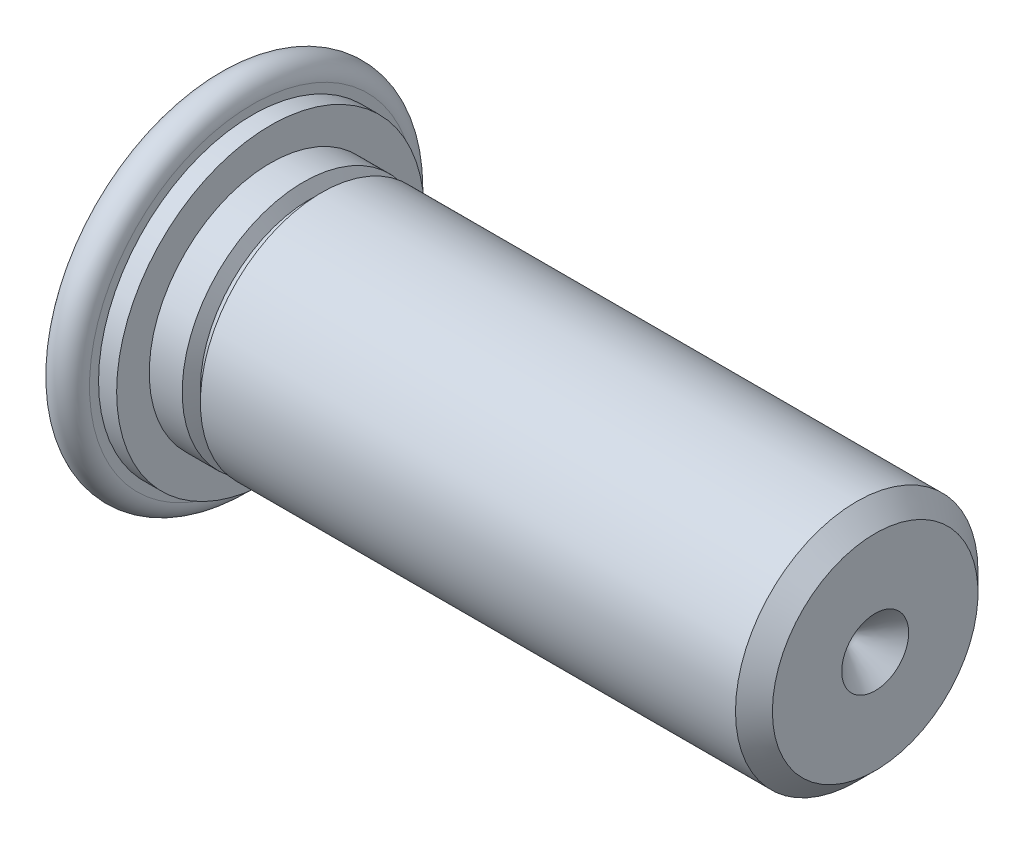
ISO-10303-21;
HEADER;
FILE_DESCRIPTION(('STEP AP214'),'2;1');
FILE_NAME('part.step','',(''),(''),'','','');
FILE_SCHEMA(('AUTOMOTIVE_DESIGN { 1 0 10303 214 1 1 1 1 }'));
ENDSEC;
DATA;
#1=APPLICATION_CONTEXT('core data for automotive mechanical design processes');
#2=APPLICATION_PROTOCOL_DEFINITION('international standard','automotive_design',2000,#1);
#3=PRODUCT_CONTEXT('',#1,'mechanical');
#4=PRODUCT('Part','Part','',(#3));
#5=PRODUCT_RELATED_PRODUCT_CATEGORY('part','',(#4));
#6=PRODUCT_DEFINITION_FORMATION('','',#4);
#7=PRODUCT_DEFINITION_CONTEXT('part definition',#1,'design');
#8=PRODUCT_DEFINITION('design','',#6,#7);
#9=PRODUCT_DEFINITION_SHAPE('','',#8);
#10=(LENGTH_UNIT() NAMED_UNIT(*) SI_UNIT(.MILLI.,.METRE.));
#11=(NAMED_UNIT(*) PLANE_ANGLE_UNIT() SI_UNIT($,.RADIAN.));
#12=(NAMED_UNIT(*) SI_UNIT($,.STERADIAN.) SOLID_ANGLE_UNIT());
#13=UNCERTAINTY_MEASURE_WITH_UNIT(LENGTH_MEASURE(1.E-05),#10,'distance_accuracy_value','');
#14=(GEOMETRIC_REPRESENTATION_CONTEXT(3) GLOBAL_UNCERTAINTY_ASSIGNED_CONTEXT((#13)) GLOBAL_UNIT_ASSIGNED_CONTEXT((#10,
#11,#12)) REPRESENTATION_CONTEXT('',''));
#15=CARTESIAN_POINT('',(0.,0.,0.));
#16=DIRECTION('',(0.,0.,1.));
#17=DIRECTION('',(1.,0.,0.));
#18=AXIS2_PLACEMENT_3D('',#15,#16,#17);
#19=CARTESIAN_POINT('',(9.525,0.,0.));
#20=DIRECTION('',(1.,0.,0.));
#21=DIRECTION('',(0.,0.,-1.));
#22=AXIS2_PLACEMENT_3D('',#19,#20,#21);
#23=CONICAL_SURFACE('',#22,0.483997,0.785398163397447);
#24=CARTESIAN_POINT('',(9.041003,0.,0.));
#25=VERTEX_POINT('',#24);
#26=VERTEX_LOOP('',#25);
#27=FACE_BOUND('',#26,.T.);
#28=CARTESIAN_POINT('',(9.525,0.,0.));
#29=DIRECTION('',(1.,0.,0.));
#30=DIRECTION('',(0.,0.,-1.));
#31=AXIS2_PLACEMENT_3D('',#28,#29,#30);
#32=CIRCLE('',#31,0.483997);
#33=CARTESIAN_POINT('',(9.525,0.,-0.483997));
#34=VERTEX_POINT('',#33);
#35=EDGE_CURVE('E19',#34,#34,#32,.F.);
#36=ORIENTED_EDGE('',*,*,#35,.F.);
#37=EDGE_LOOP('',(#36));
#38=FACE_BOUND('',#37,.T.);
#39=ADVANCED_FACE('F15',(#27,#38),#23,.F.);
#40=CARTESIAN_POINT('',(9.525,-1.4859,1.4859));
#41=DIRECTION('',(1.,0.,0.));
#42=DIRECTION('',(0.,0.,-1.));
#43=AXIS2_PLACEMENT_3D('',#40,#41,#42);
#44=PLANE('',#43);
#45=ORIENTED_EDGE('',*,*,#35,.T.);
#46=EDGE_LOOP('',(#45));
#47=FACE_BOUND('',#46,.T.);
#48=CARTESIAN_POINT('',(9.525,0.,0.));
#49=DIRECTION('',(-1.,0.,0.));
#50=DIRECTION('',(0.,0.,1.));
#51=AXIS2_PLACEMENT_3D('',#48,#49,#50);
#52=CIRCLE('',#51,1.4859);
#53=CARTESIAN_POINT('',(9.525,0.,1.4859));
#54=VERTEX_POINT('',#53);
#55=EDGE_CURVE('E34',#54,#54,#52,.T.);
#56=ORIENTED_EDGE('',*,*,#55,.F.);
#57=EDGE_LOOP('',(#56));
#58=FACE_BOUND('',#57,.T.);
#59=ADVANCED_FACE('F29',(#47,#58),#44,.T.);
#60=CARTESIAN_POINT('',(9.2583,0.,0.));
#61=DIRECTION('',(-1.,0.,0.));
#62=DIRECTION('',(0.,0.,1.));
#63=AXIS2_PLACEMENT_3D('',#60,#61,#62);
#64=CONICAL_SURFACE('',#63,1.7526,0.785398163397446);
#65=ORIENTED_EDGE('',*,*,#55,.T.);
#66=EDGE_LOOP('',(#65));
#67=FACE_BOUND('',#66,.T.);
#68=CARTESIAN_POINT('',(9.2583,0.,0.));
#69=DIRECTION('',(1.,0.,0.));
#70=DIRECTION('',(0.,0.,-1.));
#71=AXIS2_PLACEMENT_3D('',#68,#69,#70);
#72=CIRCLE('',#71,1.7526);
#73=CARTESIAN_POINT('',(9.2583,0.,-1.7526));
#74=VERTEX_POINT('',#73);
#75=EDGE_CURVE('E36',#74,#74,#72,.F.);
#76=ORIENTED_EDGE('',*,*,#75,.F.);
#77=EDGE_LOOP('',(#76));
#78=FACE_BOUND('',#77,.T.);
#79=ADVANCED_FACE('F137',(#67,#78),#64,.T.);
#80=CARTESIAN_POINT('',(1.524,0.,0.));
#81=DIRECTION('',(1.,0.,0.));
#82=DIRECTION('',(0.,0.,-1.));
#83=AXIS2_PLACEMENT_3D('',#80,#81,#82);
#84=CYLINDRICAL_SURFACE('',#83,1.7526);
#85=ORIENTED_EDGE('',*,*,#75,.T.);
#86=EDGE_LOOP('',(#85));
#87=FACE_BOUND('',#86,.T.);
#88=CARTESIAN_POINT('',(1.524,0.,0.));
#89=DIRECTION('',(1.,0.,0.));
#90=DIRECTION('',(0.,0.,-1.));
#91=AXIS2_PLACEMENT_3D('',#88,#89,#90);
#92=CIRCLE('',#91,1.7526);
#93=CARTESIAN_POINT('',(1.524,0.,-1.7526));
#94=VERTEX_POINT('',#93);
#95=EDGE_CURVE('E40',#94,#94,#92,.F.);
#96=ORIENTED_EDGE('',*,*,#95,.F.);
#97=EDGE_LOOP('',(#96));
#98=FACE_BOUND('',#97,.T.);
#99=ADVANCED_FACE('F129',(#87,#98),#84,.T.);
#100=CARTESIAN_POINT('',(1.43637,0.,0.));
#101=DIRECTION('',(1.,0.,0.));
#102=DIRECTION('',(0.,0.,-1.));
#103=AXIS2_PLACEMENT_3D('',#100,#101,#102);
#104=CONICAL_SURFACE('',#103,1.57734,1.10714871779409);
#105=CARTESIAN_POINT('',(1.43637,0.,0.));
#106=DIRECTION('',(1.,0.,0.));
#107=DIRECTION('',(0.,0.,-1.));
#108=AXIS2_PLACEMENT_3D('',#105,#106,#107);
#109=CIRCLE('',#108,1.57733999999997);
#110=CARTESIAN_POINT('',(1.43637,0.,-1.57733999999997));
#111=VERTEX_POINT('',#110);
#112=EDGE_CURVE('E45',#111,#111,#109,.F.);
#113=ORIENTED_EDGE('',*,*,#112,.F.);
#114=EDGE_LOOP('',(#113));
#115=FACE_BOUND('',#114,.T.);
#116=ORIENTED_EDGE('',*,*,#95,.T.);
#117=EDGE_LOOP('',(#116));
#118=FACE_BOUND('',#117,.T.);
#119=ADVANCED_FACE('F121',(#115,#118),#104,.T.);
#120=CARTESIAN_POINT('',(1.392555,0.,0.));
#121=DIRECTION('',(1.,0.,0.));
#122=DIRECTION('',(0.,0.,-1.));
#123=AXIS2_PLACEMENT_3D('',#120,#121,#122);
#124=TOROIDAL_SURFACE('',#123,1.6532298061336,0.08763);
#125=ORIENTED_EDGE('',*,*,#112,.T.);
#126=EDGE_LOOP('',(#125));
#127=FACE_BOUND('',#126,.T.);
#128=CARTESIAN_POINT('',(1.34874000000001,0.,0.));
#129=DIRECTION('',(-1.,0.,0.));
#130=DIRECTION('',(0.,0.,1.));
#131=AXIS2_PLACEMENT_3D('',#128,#129,#130);
#132=CIRCLE('',#131,1.57733999999999);
#133=CARTESIAN_POINT('',(1.34874000000001,0.,1.57733999999999));
#134=VERTEX_POINT('',#133);
#135=EDGE_CURVE('E48',#134,#134,#132,.T.);
#136=ORIENTED_EDGE('',*,*,#135,.F.);
#137=EDGE_LOOP('',(#136));
#138=FACE_BOUND('',#137,.T.);
#139=ADVANCED_FACE('F113',(#127,#138),#124,.F.);
#140=CARTESIAN_POINT('',(1.26111,0.,0.));
#141=DIRECTION('',(-1.,0.,0.));
#142=DIRECTION('',(0.,0.,1.));
#143=AXIS2_PLACEMENT_3D('',#140,#141,#142);
#144=CONICAL_SURFACE('',#143,1.7526,1.10714871779409);
#145=CARTESIAN_POINT('',(1.26111,0.,0.));
#146=DIRECTION('',(1.,0.,0.));
#147=DIRECTION('',(0.,0.,-1.));
#148=AXIS2_PLACEMENT_3D('',#145,#146,#147);
#149=CIRCLE('',#148,1.7526);
#150=CARTESIAN_POINT('',(1.26111,0.,-1.7526));
#151=VERTEX_POINT('',#150);
#152=EDGE_CURVE('E51',#151,#151,#149,.F.);
#153=ORIENTED_EDGE('',*,*,#152,.F.);
#154=EDGE_LOOP('',(#153));
#155=FACE_BOUND('',#154,.T.);
#156=ORIENTED_EDGE('',*,*,#135,.T.);
#157=EDGE_LOOP('',(#156));
#158=FACE_BOUND('',#157,.T.);
#159=ADVANCED_FACE('F89',(#155,#158),#144,.T.);
#160=CARTESIAN_POINT('',(0.78486,0.,0.));
#161=DIRECTION('',(1.,0.,0.));
#162=DIRECTION('',(0.,0.,-1.));
#163=AXIS2_PLACEMENT_3D('',#160,#161,#162);
#164=CYLINDRICAL_SURFACE('',#163,1.7526);
#165=ORIENTED_EDGE('',*,*,#152,.T.);
#166=EDGE_LOOP('',(#165));
#167=FACE_BOUND('',#166,.T.);
#168=CARTESIAN_POINT('',(0.78486,0.,0.));
#169=DIRECTION('',(1.,0.,0.));
#170=DIRECTION('',(0.,0.,-1.));
#171=AXIS2_PLACEMENT_3D('',#168,#169,#170);
#172=CIRCLE('',#171,1.7526);
#173=CARTESIAN_POINT('',(0.78486,0.,-1.7526));
#174=VERTEX_POINT('',#173);
#175=EDGE_CURVE('E54',#174,#174,#172,.F.);
#176=ORIENTED_EDGE('',*,*,#175,.F.);
#177=EDGE_LOOP('',(#176));
#178=FACE_BOUND('',#177,.T.);
#179=ADVANCED_FACE('F78',(#167,#178),#164,.T.);
#180=CARTESIAN_POINT('',(0.78486,2.22377,-2.22377));
#181=DIRECTION('',(1.,0.,0.));
#182=DIRECTION('',(0.,0.,1.));
#183=AXIS2_PLACEMENT_3D('',#180,#181,#182);
#184=PLANE('',#183);
#185=ORIENTED_EDGE('',*,*,#175,.T.);
#186=EDGE_LOOP('',(#185));
#187=FACE_BOUND('',#186,.T.);
#188=CARTESIAN_POINT('',(0.78486,0.,0.));
#189=DIRECTION('',(-1.,0.,0.));
#190=DIRECTION('',(0.,0.,1.));
#191=AXIS2_PLACEMENT_3D('',#188,#189,#190);
#192=CIRCLE('',#191,2.22377);
#193=CARTESIAN_POINT('',(0.78486,0.,2.22377));
#194=VERTEX_POINT('',#193);
#195=EDGE_CURVE('E57',#194,#194,#192,.T.);
#196=ORIENTED_EDGE('',*,*,#195,.F.);
#197=EDGE_LOOP('',(#196));
#198=FACE_BOUND('',#197,.T.);
#199=ADVANCED_FACE('F76',(#187,#198),#184,.T.);
#200=CARTESIAN_POINT('',(0.,-2.35458,-2.35458));
#201=DIRECTION('',(-1.,0.,0.));
#202=DIRECTION('',(0.,0.,1.));
#203=AXIS2_PLACEMENT_3D('',#200,#201,#202);
#204=PLANE('',#203);
#205=CARTESIAN_POINT('',(0.,0.,0.));
#206=DIRECTION('',(1.,0.,0.));
#207=DIRECTION('',(0.,0.,-1.));
#208=AXIS2_PLACEMENT_3D('',#205,#206,#207);
#209=CIRCLE('',#208,2.35458);
#210=CARTESIAN_POINT('',(0.,0.,-2.35458));
#211=VERTEX_POINT('',#210);
#212=EDGE_CURVE('E60',#211,#211,#209,.T.);
#213=ORIENTED_EDGE('',*,*,#212,.F.);
#214=EDGE_LOOP('',(#213));
#215=FACE_BOUND('',#214,.T.);
#216=ADVANCED_FACE('F72',(#215),#204,.T.);
#217=CARTESIAN_POINT('',(0.78486,0.,0.));
#218=DIRECTION('',(-1.,0.,0.));
#219=DIRECTION('',(0.,0.,1.));
#220=AXIS2_PLACEMENT_3D('',#217,#218,#219);
#221=CYLINDRICAL_SURFACE('',#220,2.22377);
#222=CARTESIAN_POINT('',(0.52324,0.,0.));
#223=DIRECTION('',(-1.,0.,0.));
#224=DIRECTION('',(0.,0.,1.));
#225=AXIS2_PLACEMENT_3D('',#222,#223,#224);
#226=CIRCLE('',#225,2.22377);
#227=CARTESIAN_POINT('',(0.52324,0.,2.22377));
#228=VERTEX_POINT('',#227);
#229=EDGE_CURVE('E23',#228,#228,#226,.T.);
#230=ORIENTED_EDGE('',*,*,#229,.F.);
#231=EDGE_LOOP('',(#230));
#232=FACE_BOUND('',#231,.T.);
#233=ORIENTED_EDGE('',*,*,#195,.T.);
#234=EDGE_LOOP('',(#233));
#235=FACE_BOUND('',#234,.T.);
#236=ADVANCED_FACE('F69',(#232,#235),#221,.T.);
#237=CARTESIAN_POINT('',(0.52324,-2.35458,2.35458));
#238=DIRECTION('',(1.,0.,0.));
#239=DIRECTION('',(0.,0.,-1.));
#240=AXIS2_PLACEMENT_3D('',#237,#238,#239);
#241=PLANE('',#240);
#242=ORIENTED_EDGE('',*,*,#229,.T.);
#243=EDGE_LOOP('',(#242));
#244=FACE_BOUND('',#243,.T.);
#245=CARTESIAN_POINT('',(0.52324,0.,0.));
#246=DIRECTION('',(1.,0.,0.));
#247=DIRECTION('',(0.,0.,-1.));
#248=AXIS2_PLACEMENT_3D('',#245,#246,#247);
#249=CIRCLE('',#248,2.35458);
#250=CARTESIAN_POINT('',(0.52324,0.,-2.35458));
#251=VERTEX_POINT('',#250);
#252=EDGE_CURVE('E10',#251,#251,#249,.F.);
#253=ORIENTED_EDGE('',*,*,#252,.F.);
#254=EDGE_LOOP('',(#253));
#255=FACE_BOUND('',#254,.T.);
#256=ADVANCED_FACE('F66',(#244,#255),#241,.T.);
#257=CARTESIAN_POINT('',(0.26162,0.,0.));
#258=DIRECTION('',(1.,0.,0.));
#259=DIRECTION('',(0.,0.,-1.));
#260=AXIS2_PLACEMENT_3D('',#257,#258,#259);
#261=TOROIDAL_SURFACE('',#260,2.35458,0.26162);
#262=ORIENTED_EDGE('',*,*,#212,.T.);
#263=EDGE_LOOP('',(#262));
#264=FACE_BOUND('',#263,.T.);
#265=ORIENTED_EDGE('',*,*,#252,.T.);
#266=EDGE_LOOP('',(#265));
#267=FACE_BOUND('',#266,.T.);
#268=ADVANCED_FACE('F17',(#264,#267),#261,.T.);
#269=CLOSED_SHELL('',(#39,#59,#79,#99,#119,#139,#159,#179,#199,#216,#236,#256,#268));
#270=MANIFOLD_SOLID_BREP('B1',#269);
#271=ADVANCED_BREP_SHAPE_REPRESENTATION('',(#18,#270),#14);
#272=SHAPE_DEFINITION_REPRESENTATION(#9,#271);
ENDSEC;
END-ISO-10303-21;
